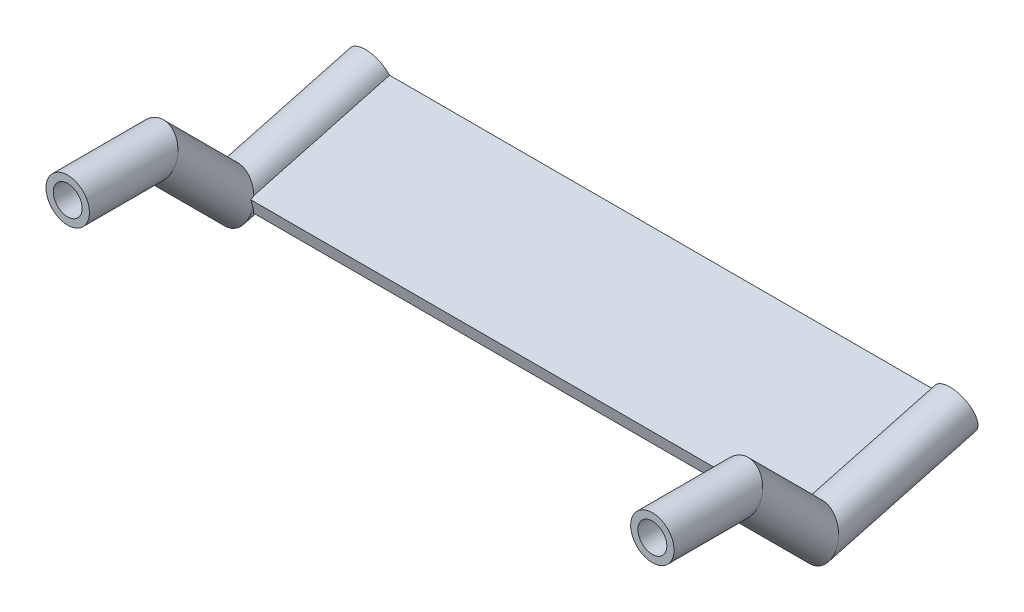
ISO-10303-21;
HEADER;
FILE_DESCRIPTION(('STEP AP214'),'2;1');
FILE_NAME('part.step','',(''),(''),'','','');
FILE_SCHEMA(('AUTOMOTIVE_DESIGN { 1 0 10303 214 1 1 1 1 }'));
ENDSEC;
DATA;
#1=APPLICATION_CONTEXT('core data for automotive mechanical design processes');
#2=APPLICATION_PROTOCOL_DEFINITION('international standard','automotive_design',2000,#1);
#3=PRODUCT_CONTEXT('',#1,'mechanical');
#4=PRODUCT('Part','Part','',(#3));
#5=PRODUCT_RELATED_PRODUCT_CATEGORY('part','',(#4));
#6=PRODUCT_DEFINITION_FORMATION('','',#4);
#7=PRODUCT_DEFINITION_CONTEXT('part definition',#1,'design');
#8=PRODUCT_DEFINITION('design','',#6,#7);
#9=PRODUCT_DEFINITION_SHAPE('','',#8);
#10=(LENGTH_UNIT() NAMED_UNIT(*) SI_UNIT(.MILLI.,.METRE.));
#11=(NAMED_UNIT(*) PLANE_ANGLE_UNIT() SI_UNIT($,.RADIAN.));
#12=(NAMED_UNIT(*) SI_UNIT($,.STERADIAN.) SOLID_ANGLE_UNIT());
#13=UNCERTAINTY_MEASURE_WITH_UNIT(LENGTH_MEASURE(1.E-05),#10,'distance_accuracy_value','');
#14=(GEOMETRIC_REPRESENTATION_CONTEXT(3) GLOBAL_UNCERTAINTY_ASSIGNED_CONTEXT((#13)) GLOBAL_UNIT_ASSIGNED_CONTEXT((#10,
#11,#12)) REPRESENTATION_CONTEXT('',''));
#15=CARTESIAN_POINT('',(0.,0.,0.));
#16=DIRECTION('',(0.,0.,1.));
#17=DIRECTION('',(1.,0.,0.));
#18=AXIS2_PLACEMENT_3D('',#15,#16,#17);
#19=CARTESIAN_POINT('',(0.,-54.3022081574775,-419.251182435796));
#20=DIRECTION('',(0.,-0.258819045102519,0.965925826289069));
#21=DIRECTION('',(0.,-0.965925826289069,-0.258819045102519));
#22=AXIS2_PLACEMENT_3D('',#19,#20,#21);
#23=PLANE('',#22);
#24=DIRECTION('',(-1.,0.,0.));
#25=VECTOR('',#24,1.);
#26=CARTESIAN_POINT('',(780.,-44.6429498945868,-416.662991984771));
#27=LINE('',#26,#25);
#28=CARTESIAN_POINT('',(780.,-44.6429498945868,-416.662991984771));
#29=VERTEX_POINT('',#28);
#30=CARTESIAN_POINT('',(28.2842712474619,-44.6429498945868,-416.662991984771));
#31=VERTEX_POINT('',#30);
#32=EDGE_CURVE('E105',#29,#31,#27,.T.);
#33=ORIENTED_EDGE('',*,*,#32,.F.);
#34=CARTESIAN_POINT('',(808.284271247462,-54.3022081574775,-419.251182435796));
#35=DIRECTION('',(0.,0.258819045102519,-0.965925826289069));
#36=DIRECTION('',(0.,-0.965925826289069,-0.258819045102519));
#37=AXIS2_PLACEMENT_3D('',#34,#35,#36);
#38=CIRCLE('',#37,30.);
#39=CARTESIAN_POINT('',(780.,-63.9614664203681,-421.839372886821));
#40=VERTEX_POINT('',#39);
#41=EDGE_CURVE('E111',#40,#29,#38,.F.);
#42=ORIENTED_EDGE('',*,*,#41,.F.);
#43=DIRECTION('',(-1.,0.,0.));
#44=VECTOR('',#43,1.);
#45=CARTESIAN_POINT('',(780.,-63.9614664203682,-421.839372886821));
#46=LINE('',#45,#44);
#47=CARTESIAN_POINT('',(28.2842712474619,-63.9614664203682,-421.839372886821));
#48=VERTEX_POINT('',#47);
#49=EDGE_CURVE('E94',#40,#48,#46,.T.);
#50=ORIENTED_EDGE('',*,*,#49,.T.);
#51=CARTESIAN_POINT('',(0.,-54.3022081574775,-419.251182435796));
#52=DIRECTION('',(0.,-0.258819045102519,0.965925826289069));
#53=DIRECTION('',(0.,-0.965925826289069,-0.258819045102519));
#54=AXIS2_PLACEMENT_3D('',#51,#52,#53);
#55=CIRCLE('',#54,30.);
#56=EDGE_CURVE('E154',#31,#48,#55,.T.);
#57=ORIENTED_EDGE('',*,*,#56,.F.);
#58=EDGE_LOOP('',(#33,#42,#50,#57));
#59=FACE_BOUND('',#58,.T.);
#60=CARTESIAN_POINT('',(0.,-54.3022081574775,-419.251182435796));
#61=DIRECTION('',(0.,-0.258819045102519,0.965925826289069));
#62=DIRECTION('',(0.,-0.965925826289069,-0.258819045102519));
#63=AXIS2_PLACEMENT_3D('',#60,#61,#62);
#64=CIRCLE('',#63,20.);
#65=CARTESIAN_POINT('',(0.,-73.6207246832589,-424.427563337846));
#66=VERTEX_POINT('',#65);
#67=EDGE_CURVE('E146',#66,#66,#64,.T.);
#68=ORIENTED_EDGE('',*,*,#67,.T.);
#69=EDGE_LOOP('',(#68));
#70=FACE_BOUND('',#69,.T.);
#71=CARTESIAN_POINT('',(808.284271247462,-54.3022081574775,-419.251182435796));
#72=DIRECTION('',(0.,-0.258819045102519,0.965925826289069));
#73=DIRECTION('',(0.,-0.965925826289069,-0.258819045102519));
#74=AXIS2_PLACEMENT_3D('',#71,#72,#73);
#75=CIRCLE('',#74,20.);
#76=CARTESIAN_POINT('',(808.284271247462,-73.6207246832589,-424.427563337846));
#77=VERTEX_POINT('',#76);
#78=EDGE_CURVE('E196',#77,#77,#75,.T.);
#79=ORIENTED_EDGE('',*,*,#78,.T.);
#80=EDGE_LOOP('',(#79));
#81=FACE_BOUND('',#80,.T.);
#82=ADVANCED_FACE('F45',(#59,#70,#81),#23,.F.);
#83=CARTESIAN_POINT('',(0.,0.,0.));
#84=DIRECTION('',(0.,0.,1.));
#85=DIRECTION('',(0.,-1.,0.));
#86=AXIS2_PLACEMENT_3D('',#83,#84,#85);
#87=PLANE('',#86);
#88=CARTESIAN_POINT('',(0.,0.,0.));
#89=DIRECTION('',(0.,0.,1.));
#90=DIRECTION('',(0.,-1.,0.));
#91=AXIS2_PLACEMENT_3D('',#88,#89,#90);
#92=CIRCLE('',#91,20.);
#93=CARTESIAN_POINT('',(0.,-20.0000000000001,0.));
#94=VERTEX_POINT('',#93);
#95=EDGE_CURVE('E150',#94,#94,#92,.T.);
#96=ORIENTED_EDGE('',*,*,#95,.F.);
#97=EDGE_LOOP('',(#96));
#98=FACE_BOUND('',#97,.T.);
#99=CARTESIAN_POINT('',(0.,0.,0.));
#100=DIRECTION('',(0.,0.,1.));
#101=DIRECTION('',(0.,-1.,0.));
#102=AXIS2_PLACEMENT_3D('',#99,#100,#101);
#103=CIRCLE('',#102,30.);
#104=CARTESIAN_POINT('',(0.,-30.0000000000001,0.));
#105=VERTEX_POINT('',#104);
#106=EDGE_CURVE('E159',#105,#105,#103,.T.);
#107=ORIENTED_EDGE('',*,*,#106,.T.);
#108=EDGE_LOOP('',(#107));
#109=FACE_BOUND('',#108,.T.);
#110=ADVANCED_FACE('F211',(#98,#109),#87,.T.);
#111=CARTESIAN_POINT('',(0.,-111.023064179415,-207.566065913123));
#112=DIRECTION('',(0.,0.258819045102519,-0.965925826289069));
#113=DIRECTION('',(0.,0.965925826289069,0.258819045102519));
#114=AXIS2_PLACEMENT_3D('',#111,#112,#113);
#115=CYLINDRICAL_SURFACE('',#114,30.);
#116=CARTESIAN_POINT('',(0.,-106.066017177981,-226.066017177983));
#117=DIRECTION('',(0.,-0.258819045102516,-0.96592582628907));
#118=DIRECTION('',(0.,-0.96592582628907,0.258819045102516));
#119=AXIS2_PLACEMENT_3D('',#116,#117,#118);
#120=ELLIPSE('',#119,34.6410161513774,30.);
#121=CARTESIAN_POINT('',(30.,-106.066017177981,-226.066017177983));
#122=VERTEX_POINT('',#121);
#123=CARTESIAN_POINT('',(28.2842712474619,-94.9124664614769,-229.05460208521));
#124=VERTEX_POINT('',#123);
#125=EDGE_CURVE('E163',#122,#124,#120,.T.);
#126=ORIENTED_EDGE('',*,*,#125,.T.);
#127=DIRECTION('',(0.,0.258819045102519,-0.965925826289069));
#128=VECTOR('',#127,1.);
#129=CARTESIAN_POINT('',(28.2842712474619,-101.363805916525,-204.977875462098));
#130=LINE('',#129,#128);
#131=EDGE_CURVE('E143',#124,#31,#130,.T.);
#132=ORIENTED_EDGE('',*,*,#131,.T.);
#133=ORIENTED_EDGE('',*,*,#56,.T.);
#134=DIRECTION('',(0.,0.258819045102519,-0.965925826289069));
#135=VECTOR('',#134,1.);
#136=CARTESIAN_POINT('',(28.2842712474619,-120.682322442306,-210.154256364148));
#137=LINE('',#136,#135);
#138=CARTESIAN_POINT('',(28.2842712474619,-115.725275440872,-228.654207629009));
#139=VERTEX_POINT('',#138);
#140=EDGE_CURVE('E12',#139,#48,#137,.T.);
#141=ORIENTED_EDGE('',*,*,#140,.F.);
#142=CARTESIAN_POINT('',(0.,-106.066017177981,-226.066017177983));
#143=DIRECTION('',(0.,-0.258819045102518,0.965925826289069));
#144=DIRECTION('',(0.,-0.965925826289069,-0.258819045102518));
#145=AXIS2_PLACEMENT_3D('',#142,#143,#144);
#146=CIRCLE('',#145,30.);
#147=EDGE_CURVE('E140',#139,#122,#146,.T.);
#148=ORIENTED_EDGE('',*,*,#147,.T.);
#149=EDGE_LOOP('',(#126,#132,#133,#141,#148));
#150=FACE_BOUND('',#149,.T.);
#151=ADVANCED_FACE('F175',(#150),#115,.T.);
#152=CARTESIAN_POINT('',(0.,9.73618689896222,-110.263813101037));
#153=DIRECTION('',(0.,-0.707106781186539,-0.707106781186556));
#154=DIRECTION('',(0.,0.707106781186556,-0.707106781186539));
#155=AXIS2_PLACEMENT_3D('',#152,#153,#154);
#156=CYLINDRICAL_SURFACE('',#155,30.);
#157=CARTESIAN_POINT('',(0.,0.,-120.));
#158=DIRECTION('',(0.,-0.382683432365084,-0.923879532511289));
#159=DIRECTION('',(0.,0.923879532511289,-0.382683432365084));
#160=AXIS2_PLACEMENT_3D('',#157,#158,#159);
#161=ELLIPSE('',#160,32.4717660087717,30.);
#162=CARTESIAN_POINT('',(0.,29.9999999999999,-132.426406871193));
#163=VERTEX_POINT('',#162);
#164=EDGE_CURVE('E162',#163,#163,#161,.T.);
#165=ORIENTED_EDGE('',*,*,#164,.T.);
#166=EDGE_LOOP('',(#165));
#167=FACE_BOUND('',#166,.T.);
#168=CARTESIAN_POINT('',(0.,-106.066017177981,-226.066017177983));
#169=DIRECTION('',(0.,-0.258819045102518,0.965925826289069));
#170=DIRECTION('',(0.,-0.965925826289069,-0.258819045102518));
#171=AXIS2_PLACEMENT_3D('',#168,#169,#170);
#172=ELLIPSE('',#171,59.9999999999985,30.);
#173=CARTESIAN_POINT('',(29.580398915498,-96.4067589150903,-223.477826726958));
#174=VERTEX_POINT('',#173);
#175=EDGE_CURVE('E104',#122,#174,#172,.T.);
#176=ORIENTED_EDGE('',*,*,#175,.T.);
#177=CARTESIAN_POINT('',(0.,-97.9010513687038,-217.901051368706));
#178=DIRECTION('',(0.,0.965925826289069,0.258819045102519));
#179=DIRECTION('',(0.,0.258819045102519,-0.965925826289069));
#180=AXIS2_PLACEMENT_3D('',#177,#178,#179);
#181=ELLIPSE('',#180,34.6410161513778,30.);
#182=EDGE_CURVE('E52',#174,#124,#181,.T.);
#183=ORIENTED_EDGE('',*,*,#182,.T.);
#184=ORIENTED_EDGE('',*,*,#125,.F.);
#185=EDGE_LOOP('',(#176,#183,#184));
#186=FACE_BOUND('',#185,.T.);
#187=ADVANCED_FACE('F172',(#167,#186),#156,.T.);
#188=CARTESIAN_POINT('',(0.,0.,0.));
#189=DIRECTION('',(0.,0.,-1.));
#190=DIRECTION('',(-1.,0.,0.));
#191=AXIS2_PLACEMENT_3D('',#188,#189,#190);
#192=CYLINDRICAL_SURFACE('',#191,30.);
#193=ORIENTED_EDGE('',*,*,#106,.F.);
#194=EDGE_LOOP('',(#193));
#195=FACE_BOUND('',#194,.T.);
#196=ORIENTED_EDGE('',*,*,#164,.F.);
#197=EDGE_LOOP('',(#196));
#198=FACE_BOUND('',#197,.T.);
#199=ADVANCED_FACE('F221',(#195,#198),#192,.T.);
#200=CARTESIAN_POINT('',(0.,-111.023064179415,-207.566065913123));
#201=DIRECTION('',(0.,0.258819045102519,-0.965925826289069));
#202=DIRECTION('',(0.,0.965925826289069,0.258819045102519));
#203=AXIS2_PLACEMENT_3D('',#200,#201,#202);
#204=CYLINDRICAL_SURFACE('',#203,20.);
#205=ORIENTED_EDGE('',*,*,#67,.F.);
#206=EDGE_LOOP('',(#205));
#207=FACE_BOUND('',#206,.T.);
#208=CARTESIAN_POINT('',(0.,-106.066017177981,-226.066017177983));
#209=DIRECTION('',(0.,-0.258819045102516,-0.96592582628907));
#210=DIRECTION('',(0.,0.96592582628907,-0.258819045102516));
#211=AXIS2_PLACEMENT_3D('',#208,#209,#210);
#212=ELLIPSE('',#211,23.0940107675849,20.);
#213=CARTESIAN_POINT('',(0.,-83.7589157449728,-232.043186992437));
#214=VERTEX_POINT('',#213);
#215=EDGE_CURVE('E147',#214,#214,#212,.T.);
#216=ORIENTED_EDGE('',*,*,#215,.F.);
#217=EDGE_LOOP('',(#216));
#218=FACE_BOUND('',#217,.T.);
#219=ADVANCED_FACE('F223',(#207,#218),#204,.F.);
#220=CARTESIAN_POINT('',(0.,9.73618689896222,-110.263813101037));
#221=DIRECTION('',(0.,-0.707106781186539,-0.707106781186556));
#222=DIRECTION('',(0.,0.707106781186556,-0.707106781186539));
#223=AXIS2_PLACEMENT_3D('',#220,#221,#222);
#224=CYLINDRICAL_SURFACE('',#223,20.);
#225=CARTESIAN_POINT('',(0.,0.,-120.));
#226=DIRECTION('',(0.,-0.382683432365084,-0.923879532511289));
#227=DIRECTION('',(0.,-0.923879532511289,0.382683432365084));
#228=AXIS2_PLACEMENT_3D('',#225,#226,#227);
#229=ELLIPSE('',#228,21.6478440058478,20.);
#230=CARTESIAN_POINT('',(0.,-20.0000000000001,-111.715728752538));
#231=VERTEX_POINT('',#230);
#232=EDGE_CURVE('E151',#231,#231,#229,.T.);
#233=ORIENTED_EDGE('',*,*,#232,.F.);
#234=EDGE_LOOP('',(#233));
#235=FACE_BOUND('',#234,.T.);
#236=ORIENTED_EDGE('',*,*,#215,.T.);
#237=EDGE_LOOP('',(#236));
#238=FACE_BOUND('',#237,.T.);
#239=ADVANCED_FACE('F218',(#235,#238),#224,.F.);
#240=CARTESIAN_POINT('',(0.,0.,0.));
#241=DIRECTION('',(0.,0.,-1.));
#242=DIRECTION('',(-1.,0.,0.));
#243=AXIS2_PLACEMENT_3D('',#240,#241,#242);
#244=CYLINDRICAL_SURFACE('',#243,20.);
#245=ORIENTED_EDGE('',*,*,#95,.T.);
#246=EDGE_LOOP('',(#245));
#247=FACE_BOUND('',#246,.T.);
#248=ORIENTED_EDGE('',*,*,#232,.T.);
#249=EDGE_LOOP('',(#248));
#250=FACE_BOUND('',#249,.T.);
#251=ADVANCED_FACE('F212',(#247,#250),#244,.F.);
#252=CARTESIAN_POINT('',(780.,-115.725275440872,-228.654207629009));
#253=DIRECTION('',(0.,0.965925826289069,0.258819045102519));
#254=DIRECTION('',(0.,-0.258819045102519,0.965925826289069));
#255=AXIS2_PLACEMENT_3D('',#252,#253,#254);
#256=PLANE('',#255);
#257=DIRECTION('',(-1.,0.,0.));
#258=VECTOR('',#257,1.);
#259=CARTESIAN_POINT('',(780.,-115.725275440872,-228.654207629009));
#260=LINE('',#259,#258);
#261=CARTESIAN_POINT('',(780.,-115.725275440872,-228.654207629009));
#262=VERTEX_POINT('',#261);
#263=EDGE_CURVE('E133',#262,#139,#260,.T.);
#264=ORIENTED_EDGE('',*,*,#263,.T.);
#265=ORIENTED_EDGE('',*,*,#140,.T.);
#266=ORIENTED_EDGE('',*,*,#49,.F.);
#267=DIRECTION('',(0.,0.258819045102519,-0.965925826289069));
#268=VECTOR('',#267,1.);
#269=CARTESIAN_POINT('',(780.,-115.725275440872,-228.654207629009));
#270=LINE('',#269,#268);
#271=EDGE_CURVE('E98',#262,#40,#270,.T.);
#272=ORIENTED_EDGE('',*,*,#271,.F.);
#273=EDGE_LOOP('',(#264,#265,#266,#272));
#274=FACE_BOUND('',#273,.T.);
#275=ADVANCED_FACE('F97',(#274),#256,.F.);
#276=CARTESIAN_POINT('',(780.,-96.4067589150903,-223.477826726958));
#277=DIRECTION('',(0.,0.965925826289069,0.258819045102519));
#278=DIRECTION('',(0.,-0.258819045102519,0.965925826289069));
#279=AXIS2_PLACEMENT_3D('',#276,#277,#278);
#280=PLANE('',#279);
#281=DIRECTION('',(-1.,0.,0.));
#282=VECTOR('',#281,1.);
#283=CARTESIAN_POINT('',(780.,-96.4067589150903,-223.477826726958));
#284=LINE('',#283,#282);
#285=CARTESIAN_POINT('',(778.703872331964,-96.4067589150903,-223.477826726958));
#286=VERTEX_POINT('',#285);
#287=EDGE_CURVE('E135',#286,#174,#284,.T.);
#288=ORIENTED_EDGE('',*,*,#287,.F.);
#289=CARTESIAN_POINT('',(808.284271247462,-97.9010513687038,-217.901051368706));
#290=DIRECTION('',(0.,0.965925826289069,0.258819045102519));
#291=DIRECTION('',(0.,0.258819045102519,-0.965925826289069));
#292=AXIS2_PLACEMENT_3D('',#289,#290,#291);
#293=ELLIPSE('',#292,34.6410161513778,30.);
#294=CARTESIAN_POINT('',(780.,-94.9124664614769,-229.05460208521));
#295=VERTEX_POINT('',#294);
#296=EDGE_CURVE('E128',#286,#295,#293,.F.);
#297=ORIENTED_EDGE('',*,*,#296,.T.);
#298=DIRECTION('',(0.,0.258819045102519,-0.965925826289069));
#299=VECTOR('',#298,1.);
#300=CARTESIAN_POINT('',(780.,-96.4067589150903,-223.477826726958));
#301=LINE('',#300,#299);
#302=EDGE_CURVE('E113',#295,#29,#301,.T.);
#303=ORIENTED_EDGE('',*,*,#302,.T.);
#304=ORIENTED_EDGE('',*,*,#32,.T.);
#305=ORIENTED_EDGE('',*,*,#131,.F.);
#306=ORIENTED_EDGE('',*,*,#182,.F.);
#307=EDGE_LOOP('',(#288,#297,#303,#304,#305,#306));
#308=FACE_BOUND('',#307,.T.);
#309=ADVANCED_FACE('F178',(#308),#280,.T.);
#310=CARTESIAN_POINT('',(780.,-115.725275440872,-228.654207629009));
#311=DIRECTION('',(0.,-0.258819045102518,0.965925826289069));
#312=DIRECTION('',(0.,-0.965925826289069,-0.258819045102518));
#313=AXIS2_PLACEMENT_3D('',#310,#311,#312);
#314=PLANE('',#313);
#315=ORIENTED_EDGE('',*,*,#263,.F.);
#316=CARTESIAN_POINT('',(808.284271247462,-106.066017177981,-226.066017177983));
#317=DIRECTION('',(0.,-0.258819045102518,0.965925826289069));
#318=DIRECTION('',(0.,-0.965925826289069,-0.258819045102518));
#319=AXIS2_PLACEMENT_3D('',#316,#317,#318);
#320=CIRCLE('',#319,30.);
#321=CARTESIAN_POINT('',(778.284271247462,-106.066017177981,-226.066017177983));
#322=VERTEX_POINT('',#321);
#323=EDGE_CURVE('E59',#262,#322,#320,.F.);
#324=ORIENTED_EDGE('',*,*,#323,.T.);
#325=CARTESIAN_POINT('',(808.284271247462,-106.066017177981,-226.066017177983));
#326=DIRECTION('',(0.,-0.258819045102518,0.965925826289069));
#327=DIRECTION('',(0.,-0.965925826289069,-0.258819045102518));
#328=AXIS2_PLACEMENT_3D('',#325,#326,#327);
#329=ELLIPSE('',#328,59.9999999999985,30.);
#330=EDGE_CURVE('E63',#322,#286,#329,.F.);
#331=ORIENTED_EDGE('',*,*,#330,.T.);
#332=ORIENTED_EDGE('',*,*,#287,.T.);
#333=ORIENTED_EDGE('',*,*,#175,.F.);
#334=ORIENTED_EDGE('',*,*,#147,.F.);
#335=EDGE_LOOP('',(#315,#324,#331,#332,#333,#334));
#336=FACE_BOUND('',#335,.T.);
#337=ADVANCED_FACE('F176',(#336),#314,.T.);
#338=CARTESIAN_POINT('',(808.284271247462,-111.023064179415,-207.566065913123));
#339=DIRECTION('',(0.,0.258819045102519,-0.965925826289069));
#340=DIRECTION('',(0.,0.965925826289069,0.258819045102519));
#341=AXIS2_PLACEMENT_3D('',#338,#339,#340);
#342=CYLINDRICAL_SURFACE('',#341,30.);
#343=ORIENTED_EDGE('',*,*,#41,.T.);
#344=ORIENTED_EDGE('',*,*,#302,.F.);
#345=CARTESIAN_POINT('',(808.284271247462,-106.066017177981,-226.066017177983));
#346=DIRECTION('',(0.,-0.258819045102516,-0.96592582628907));
#347=DIRECTION('',(0.,-0.96592582628907,0.258819045102516));
#348=AXIS2_PLACEMENT_3D('',#345,#346,#347);
#349=ELLIPSE('',#348,34.6410161513774,30.);
#350=EDGE_CURVE('E117',#295,#322,#349,.T.);
#351=ORIENTED_EDGE('',*,*,#350,.T.);
#352=ORIENTED_EDGE('',*,*,#323,.F.);
#353=ORIENTED_EDGE('',*,*,#271,.T.);
#354=EDGE_LOOP('',(#343,#344,#351,#352,#353));
#355=FACE_BOUND('',#354,.T.);
#356=ADVANCED_FACE('F109',(#355),#342,.T.);
#357=CARTESIAN_POINT('',(808.284271247462,0.,0.));
#358=DIRECTION('',(0.,0.,1.));
#359=DIRECTION('',(0.,-1.,0.));
#360=AXIS2_PLACEMENT_3D('',#357,#358,#359);
#361=PLANE('',#360);
#362=CARTESIAN_POINT('',(808.284271247462,0.,0.));
#363=DIRECTION('',(0.,0.,1.));
#364=DIRECTION('',(0.,-1.,0.));
#365=AXIS2_PLACEMENT_3D('',#362,#363,#364);
#366=CIRCLE('',#365,20.);
#367=CARTESIAN_POINT('',(808.284271247462,-20.0000000000001,0.));
#368=VERTEX_POINT('',#367);
#369=EDGE_CURVE('E123',#368,#368,#366,.T.);
#370=ORIENTED_EDGE('',*,*,#369,.F.);
#371=EDGE_LOOP('',(#370));
#372=FACE_BOUND('',#371,.T.);
#373=CARTESIAN_POINT('',(808.284271247462,0.,0.));
#374=DIRECTION('',(0.,0.,-1.));
#375=DIRECTION('',(0.,-1.,0.));
#376=AXIS2_PLACEMENT_3D('',#373,#374,#375);
#377=CIRCLE('',#376,30.);
#378=CARTESIAN_POINT('',(808.284271247462,-30.0000000000001,0.));
#379=VERTEX_POINT('',#378);
#380=EDGE_CURVE('E120',#379,#379,#377,.F.);
#381=ORIENTED_EDGE('',*,*,#380,.T.);
#382=EDGE_LOOP('',(#381));
#383=FACE_BOUND('',#382,.T.);
#384=ADVANCED_FACE('F185',(#372,#383),#361,.T.);
#385=CARTESIAN_POINT('',(808.284271247462,9.73618689896222,-110.263813101037));
#386=DIRECTION('',(0.,-0.707106781186539,-0.707106781186556));
#387=DIRECTION('',(0.,0.707106781186556,-0.707106781186539));
#388=AXIS2_PLACEMENT_3D('',#385,#386,#387);
#389=CYLINDRICAL_SURFACE('',#388,30.);
#390=ORIENTED_EDGE('',*,*,#296,.F.);
#391=ORIENTED_EDGE('',*,*,#330,.F.);
#392=ORIENTED_EDGE('',*,*,#350,.F.);
#393=EDGE_LOOP('',(#390,#391,#392));
#394=FACE_BOUND('',#393,.T.);
#395=CARTESIAN_POINT('',(808.284271247462,0.,-120.));
#396=DIRECTION('',(0.,-0.382683432365084,-0.923879532511289));
#397=DIRECTION('',(0.,0.923879532511289,-0.382683432365084));
#398=AXIS2_PLACEMENT_3D('',#395,#396,#397);
#399=ELLIPSE('',#398,32.4717660087717,30.);
#400=CARTESIAN_POINT('',(808.284271247462,29.9999999999999,-132.426406871193));
#401=VERTEX_POINT('',#400);
#402=EDGE_CURVE('E129',#401,#401,#399,.T.);
#403=ORIENTED_EDGE('',*,*,#402,.T.);
#404=EDGE_LOOP('',(#403));
#405=FACE_BOUND('',#404,.T.);
#406=ADVANCED_FACE('F181',(#394,#405),#389,.T.);
#407=CARTESIAN_POINT('',(808.284271247462,0.,0.));
#408=DIRECTION('',(0.,0.,-1.));
#409=DIRECTION('',(-1.,0.,0.));
#410=AXIS2_PLACEMENT_3D('',#407,#408,#409);
#411=CYLINDRICAL_SURFACE('',#410,30.);
#412=ORIENTED_EDGE('',*,*,#380,.F.);
#413=EDGE_LOOP('',(#412));
#414=FACE_BOUND('',#413,.T.);
#415=ORIENTED_EDGE('',*,*,#402,.F.);
#416=EDGE_LOOP('',(#415));
#417=FACE_BOUND('',#416,.T.);
#418=ADVANCED_FACE('F184',(#414,#417),#411,.T.);
#419=CARTESIAN_POINT('',(808.284271247462,-111.023064179415,-207.566065913123));
#420=DIRECTION('',(0.,0.258819045102519,-0.965925826289069));
#421=DIRECTION('',(0.,0.965925826289069,0.258819045102519));
#422=AXIS2_PLACEMENT_3D('',#419,#420,#421);
#423=CYLINDRICAL_SURFACE('',#422,20.);
#424=CARTESIAN_POINT('',(808.284271247462,-106.066017177981,-226.066017177983));
#425=DIRECTION('',(0.,-0.258819045102516,-0.96592582628907));
#426=DIRECTION('',(0.,0.96592582628907,-0.258819045102516));
#427=AXIS2_PLACEMENT_3D('',#424,#425,#426);
#428=ELLIPSE('',#427,23.0940107675849,20.);
#429=CARTESIAN_POINT('',(808.284271247462,-83.7589157449728,-232.043186992437));
#430=VERTEX_POINT('',#429);
#431=EDGE_CURVE('E195',#430,#430,#428,.T.);
#432=ORIENTED_EDGE('',*,*,#431,.F.);
#433=EDGE_LOOP('',(#432));
#434=FACE_BOUND('',#433,.T.);
#435=ORIENTED_EDGE('',*,*,#78,.F.);
#436=EDGE_LOOP('',(#435));
#437=FACE_BOUND('',#436,.T.);
#438=ADVANCED_FACE('F204',(#434,#437),#423,.F.);
#439=CARTESIAN_POINT('',(808.284271247462,9.73618689896222,-110.263813101037));
#440=DIRECTION('',(0.,-0.707106781186539,-0.707106781186556));
#441=DIRECTION('',(0.,0.707106781186556,-0.707106781186539));
#442=AXIS2_PLACEMENT_3D('',#439,#440,#441);
#443=CYLINDRICAL_SURFACE('',#442,20.);
#444=CARTESIAN_POINT('',(808.284271247462,0.,-120.));
#445=DIRECTION('',(0.,-0.382683432365084,-0.923879532511289));
#446=DIRECTION('',(0.,-0.923879532511289,0.382683432365084));
#447=AXIS2_PLACEMENT_3D('',#444,#445,#446);
#448=ELLIPSE('',#447,21.6478440058478,20.);
#449=CARTESIAN_POINT('',(808.284271247462,-20.0000000000001,-111.715728752538));
#450=VERTEX_POINT('',#449);
#451=EDGE_CURVE('E118',#450,#450,#448,.T.);
#452=ORIENTED_EDGE('',*,*,#451,.F.);
#453=EDGE_LOOP('',(#452));
#454=FACE_BOUND('',#453,.T.);
#455=ORIENTED_EDGE('',*,*,#431,.T.);
#456=EDGE_LOOP('',(#455));
#457=FACE_BOUND('',#456,.T.);
#458=ADVANCED_FACE('F202',(#454,#457),#443,.F.);
#459=CARTESIAN_POINT('',(808.284271247462,0.,0.));
#460=DIRECTION('',(0.,0.,-1.));
#461=DIRECTION('',(-1.,0.,0.));
#462=AXIS2_PLACEMENT_3D('',#459,#460,#461);
#463=CYLINDRICAL_SURFACE('',#462,20.);
#464=ORIENTED_EDGE('',*,*,#369,.T.);
#465=EDGE_LOOP('',(#464));
#466=FACE_BOUND('',#465,.T.);
#467=ORIENTED_EDGE('',*,*,#451,.T.);
#468=EDGE_LOOP('',(#467));
#469=FACE_BOUND('',#468,.T.);
#470=ADVANCED_FACE('F312',(#466,#469),#463,.F.);
#471=CLOSED_SHELL('',(#82,#110,#151,#187,#199,#219,#239,#251,#275,#309,#337,#356,#384,#406,#418,
#438,#458,#470));
#472=MANIFOLD_SOLID_BREP('B2',#471);
#473=ADVANCED_BREP_SHAPE_REPRESENTATION('',(#18,#472),#14);
#474=SHAPE_DEFINITION_REPRESENTATION(#9,#473);
ENDSEC;
END-ISO-10303-21;
